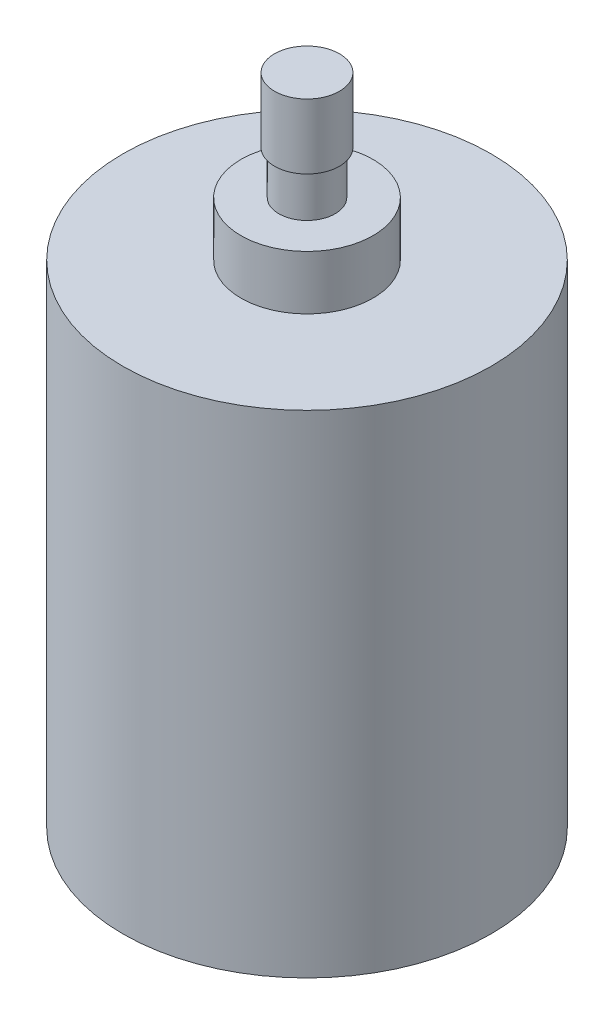
ISO-10303-21;
HEADER;
FILE_DESCRIPTION(('STEP AP214'),'2;1');
FILE_NAME('part.step','',(''),(''),'','','');
FILE_SCHEMA(('AUTOMOTIVE_DESIGN { 1 0 10303 214 1 1 1 1 }'));
ENDSEC;
DATA;
#1=APPLICATION_CONTEXT('core data for automotive mechanical design processes');
#2=APPLICATION_PROTOCOL_DEFINITION('international standard','automotive_design',2000,#1);
#3=PRODUCT_CONTEXT('',#1,'mechanical');
#4=PRODUCT('Part','Part','',(#3));
#5=PRODUCT_RELATED_PRODUCT_CATEGORY('part','',(#4));
#6=PRODUCT_DEFINITION_FORMATION('','',#4);
#7=PRODUCT_DEFINITION_CONTEXT('part definition',#1,'design');
#8=PRODUCT_DEFINITION('design','',#6,#7);
#9=PRODUCT_DEFINITION_SHAPE('','',#8);
#10=(LENGTH_UNIT() NAMED_UNIT(*) SI_UNIT(.MILLI.,.METRE.));
#11=(NAMED_UNIT(*) PLANE_ANGLE_UNIT() SI_UNIT($,.RADIAN.));
#12=(NAMED_UNIT(*) SI_UNIT($,.STERADIAN.) SOLID_ANGLE_UNIT());
#13=UNCERTAINTY_MEASURE_WITH_UNIT(LENGTH_MEASURE(1.E-05),#10,'distance_accuracy_value','');
#14=(GEOMETRIC_REPRESENTATION_CONTEXT(3) GLOBAL_UNCERTAINTY_ASSIGNED_CONTEXT((#13)) GLOBAL_UNIT_ASSIGNED_CONTEXT((#10,
#11,#12)) REPRESENTATION_CONTEXT('',''));
#15=CARTESIAN_POINT('',(0.,0.,0.));
#16=DIRECTION('',(0.,0.,1.));
#17=DIRECTION('',(1.,0.,0.));
#18=AXIS2_PLACEMENT_3D('',#15,#16,#17);
#19=CARTESIAN_POINT('',(0.,30.2,0.));
#20=DIRECTION('',(0.,1.,0.));
#21=DIRECTION('',(-1.,0.,0.));
#22=AXIS2_PLACEMENT_3D('',#19,#20,#21);
#23=CYLINDRICAL_SURFACE('',#22,2.3);
#24=CARTESIAN_POINT('',(0.,-2.5,0.));
#25=DIRECTION('',(0.,1.,0.));
#26=DIRECTION('',(-1.,0.,0.));
#27=AXIS2_PLACEMENT_3D('',#24,#25,#26);
#28=CIRCLE('',#27,2.29999999999999);
#29=CARTESIAN_POINT('',(-2.29999999999998,-2.5,0.));
#30=VERTEX_POINT('',#29);
#31=EDGE_CURVE('E10',#30,#30,#28,.T.);
#32=ORIENTED_EDGE('',*,*,#31,.T.);
#33=EDGE_LOOP('',(#32));
#34=FACE_BOUND('',#33,.T.);
#35=CARTESIAN_POINT('',(0.,0.,0.));
#36=DIRECTION('',(0.,1.,0.));
#37=DIRECTION('',(-1.,0.,0.));
#38=AXIS2_PLACEMENT_3D('',#35,#36,#37);
#39=CIRCLE('',#38,2.3);
#40=CARTESIAN_POINT('',(-2.29999999999999,0.,0.));
#41=VERTEX_POINT('',#40);
#42=EDGE_CURVE('E62',#41,#41,#39,.T.);
#43=ORIENTED_EDGE('',*,*,#42,.F.);
#44=EDGE_LOOP('',(#43));
#45=FACE_BOUND('',#44,.T.);
#46=ADVANCED_FACE('F28',(#34,#45),#23,.T.);
#47=CARTESIAN_POINT('',(0.,-2.5,0.));
#48=DIRECTION('',(0.,-1.,0.));
#49=DIRECTION('',(1.,0.,0.));
#50=AXIS2_PLACEMENT_3D('',#47,#48,#49);
#51=PLANE('',#50);
#52=ORIENTED_EDGE('',*,*,#31,.F.);
#53=EDGE_LOOP('',(#52));
#54=FACE_BOUND('',#53,.T.);
#55=ADVANCED_FACE('F70',(#54),#51,.T.);
#56=CARTESIAN_POINT('',(-1.5,30.2,0.));
#57=DIRECTION('',(0.,1.,0.));
#58=DIRECTION('',(-1.,0.,0.));
#59=AXIS2_PLACEMENT_3D('',#56,#57,#58);
#60=PLANE('',#59);
#61=CARTESIAN_POINT('',(0.,30.2,0.));
#62=DIRECTION('',(0.,1.,0.));
#63=DIRECTION('',(-1.,0.,0.));
#64=AXIS2_PLACEMENT_3D('',#61,#62,#63);
#65=CIRCLE('',#64,1.50000000000001);
#66=CARTESIAN_POINT('',(-1.5,30.2,0.));
#67=VERTEX_POINT('',#66);
#68=EDGE_CURVE('E34',#67,#67,#65,.T.);
#69=ORIENTED_EDGE('',*,*,#68,.T.);
#70=EDGE_LOOP('',(#69));
#71=FACE_BOUND('',#70,.T.);
#72=ADVANCED_FACE('F74',(#71),#60,.T.);
#73=CARTESIAN_POINT('',(0.,30.2,0.));
#74=DIRECTION('',(0.,1.,0.));
#75=DIRECTION('',(-1.,0.,0.));
#76=AXIS2_PLACEMENT_3D('',#73,#74,#75);
#77=CYLINDRICAL_SURFACE('',#76,1.50000000000001);
#78=CARTESIAN_POINT('',(0.,27.2,0.));
#79=DIRECTION('',(0.,1.,0.));
#80=DIRECTION('',(-1.,0.,0.));
#81=AXIS2_PLACEMENT_3D('',#78,#79,#80);
#82=CIRCLE('',#81,1.50000000000001);
#83=CARTESIAN_POINT('',(-1.5,27.2,0.));
#84=VERTEX_POINT('',#83);
#85=EDGE_CURVE('E38',#84,#84,#82,.T.);
#86=ORIENTED_EDGE('',*,*,#85,.T.);
#87=EDGE_LOOP('',(#86));
#88=FACE_BOUND('',#87,.T.);
#89=ORIENTED_EDGE('',*,*,#68,.F.);
#90=EDGE_LOOP('',(#89));
#91=FACE_BOUND('',#90,.T.);
#92=ADVANCED_FACE('F79',(#88,#91),#77,.T.);
#93=CARTESIAN_POINT('',(-1.29999999999999,27.2,0.));
#94=DIRECTION('',(0.,-1.,0.));
#95=DIRECTION('',(1.,0.,0.));
#96=AXIS2_PLACEMENT_3D('',#93,#94,#95);
#97=PLANE('',#96);
#98=CARTESIAN_POINT('',(0.,27.2,0.));
#99=DIRECTION('',(0.,1.,0.));
#100=DIRECTION('',(-1.,0.,0.));
#101=AXIS2_PLACEMENT_3D('',#98,#99,#100);
#102=CIRCLE('',#101,1.3);
#103=CARTESIAN_POINT('',(-1.29999999999999,27.2,0.));
#104=VERTEX_POINT('',#103);
#105=EDGE_CURVE('E42',#104,#104,#102,.T.);
#106=ORIENTED_EDGE('',*,*,#105,.T.);
#107=EDGE_LOOP('',(#106));
#108=FACE_BOUND('',#107,.T.);
#109=ORIENTED_EDGE('',*,*,#85,.F.);
#110=EDGE_LOOP('',(#109));
#111=FACE_BOUND('',#110,.T.);
#112=ADVANCED_FACE('F84',(#108,#111),#97,.T.);
#113=CARTESIAN_POINT('',(0.,30.2,0.));
#114=DIRECTION('',(0.,1.,0.));
#115=DIRECTION('',(-1.,0.,0.));
#116=AXIS2_PLACEMENT_3D('',#113,#114,#115);
#117=CYLINDRICAL_SURFACE('',#116,1.3);
#118=CARTESIAN_POINT('',(0.,25.2,0.));
#119=DIRECTION('',(0.,1.,0.));
#120=DIRECTION('',(-1.,0.,0.));
#121=AXIS2_PLACEMENT_3D('',#118,#119,#120);
#122=CIRCLE('',#121,1.3);
#123=CARTESIAN_POINT('',(-1.3,25.2,0.));
#124=VERTEX_POINT('',#123);
#125=EDGE_CURVE('E47',#124,#124,#122,.T.);
#126=ORIENTED_EDGE('',*,*,#125,.T.);
#127=EDGE_LOOP('',(#126));
#128=FACE_BOUND('',#127,.T.);
#129=ORIENTED_EDGE('',*,*,#105,.F.);
#130=EDGE_LOOP('',(#129));
#131=FACE_BOUND('',#130,.T.);
#132=ADVANCED_FACE('F88',(#128,#131),#117,.T.);
#133=CARTESIAN_POINT('',(-3.04999999999999,25.2,0.));
#134=DIRECTION('',(0.,1.,0.));
#135=DIRECTION('',(-1.,0.,0.));
#136=AXIS2_PLACEMENT_3D('',#133,#134,#135);
#137=PLANE('',#136);
#138=CARTESIAN_POINT('',(0.,25.2,0.));
#139=DIRECTION('',(0.,1.,0.));
#140=DIRECTION('',(-1.,0.,0.));
#141=AXIS2_PLACEMENT_3D('',#138,#139,#140);
#142=CIRCLE('',#141,3.05);
#143=CARTESIAN_POINT('',(-3.04999999999999,25.2,0.));
#144=VERTEX_POINT('',#143);
#145=EDGE_CURVE('E50',#144,#144,#142,.T.);
#146=ORIENTED_EDGE('',*,*,#145,.T.);
#147=EDGE_LOOP('',(#146));
#148=FACE_BOUND('',#147,.T.);
#149=ORIENTED_EDGE('',*,*,#125,.F.);
#150=EDGE_LOOP('',(#149));
#151=FACE_BOUND('',#150,.T.);
#152=ADVANCED_FACE('F92',(#148,#151),#137,.T.);
#153=CARTESIAN_POINT('',(0.,30.2,0.));
#154=DIRECTION('',(0.,1.,0.));
#155=DIRECTION('',(-1.,0.,0.));
#156=AXIS2_PLACEMENT_3D('',#153,#154,#155);
#157=CYLINDRICAL_SURFACE('',#156,3.05);
#158=CARTESIAN_POINT('',(0.,22.7,0.));
#159=DIRECTION('',(0.,1.,0.));
#160=DIRECTION('',(-1.,0.,0.));
#161=AXIS2_PLACEMENT_3D('',#158,#159,#160);
#162=CIRCLE('',#161,3.05);
#163=CARTESIAN_POINT('',(-3.05,22.7,0.));
#164=VERTEX_POINT('',#163);
#165=EDGE_CURVE('E53',#164,#164,#162,.T.);
#166=ORIENTED_EDGE('',*,*,#165,.T.);
#167=EDGE_LOOP('',(#166));
#168=FACE_BOUND('',#167,.T.);
#169=ORIENTED_EDGE('',*,*,#145,.F.);
#170=EDGE_LOOP('',(#169));
#171=FACE_BOUND('',#170,.T.);
#172=ADVANCED_FACE('F96',(#168,#171),#157,.T.);
#173=CARTESIAN_POINT('',(-8.49999999999999,22.7,0.));
#174=DIRECTION('',(0.,1.,0.));
#175=DIRECTION('',(-1.,0.,0.));
#176=AXIS2_PLACEMENT_3D('',#173,#174,#175);
#177=PLANE('',#176);
#178=CARTESIAN_POINT('',(0.,22.7,0.));
#179=DIRECTION('',(0.,1.,0.));
#180=DIRECTION('',(-1.,0.,0.));
#181=AXIS2_PLACEMENT_3D('',#178,#179,#180);
#182=CIRCLE('',#181,8.5);
#183=CARTESIAN_POINT('',(-8.49999999999999,22.7,0.));
#184=VERTEX_POINT('',#183);
#185=EDGE_CURVE('E56',#184,#184,#182,.T.);
#186=ORIENTED_EDGE('',*,*,#185,.T.);
#187=EDGE_LOOP('',(#186));
#188=FACE_BOUND('',#187,.T.);
#189=ORIENTED_EDGE('',*,*,#165,.F.);
#190=EDGE_LOOP('',(#189));
#191=FACE_BOUND('',#190,.T.);
#192=ADVANCED_FACE('F100',(#188,#191),#177,.T.);
#193=CARTESIAN_POINT('',(0.,30.2,0.));
#194=DIRECTION('',(0.,1.,0.));
#195=DIRECTION('',(-1.,0.,0.));
#196=AXIS2_PLACEMENT_3D('',#193,#194,#195);
#197=CYLINDRICAL_SURFACE('',#196,8.5);
#198=CARTESIAN_POINT('',(0.,0.,0.));
#199=DIRECTION('',(0.,1.,0.));
#200=DIRECTION('',(-1.,0.,0.));
#201=AXIS2_PLACEMENT_3D('',#198,#199,#200);
#202=CIRCLE('',#201,8.5);
#203=CARTESIAN_POINT('',(-8.49999999999999,0.,0.));
#204=VERTEX_POINT('',#203);
#205=EDGE_CURVE('E59',#204,#204,#202,.T.);
#206=ORIENTED_EDGE('',*,*,#205,.T.);
#207=EDGE_LOOP('',(#206));
#208=FACE_BOUND('',#207,.T.);
#209=ORIENTED_EDGE('',*,*,#185,.F.);
#210=EDGE_LOOP('',(#209));
#211=FACE_BOUND('',#210,.T.);
#212=ADVANCED_FACE('F104',(#208,#211),#197,.T.);
#213=CARTESIAN_POINT('',(-2.29999999999999,0.,0.));
#214=DIRECTION('',(0.,-1.,0.));
#215=DIRECTION('',(1.,0.,0.));
#216=AXIS2_PLACEMENT_3D('',#213,#214,#215);
#217=PLANE('',#216);
#218=ORIENTED_EDGE('',*,*,#42,.T.);
#219=EDGE_LOOP('',(#218));
#220=FACE_BOUND('',#219,.T.);
#221=ORIENTED_EDGE('',*,*,#205,.F.);
#222=EDGE_LOOP('',(#221));
#223=FACE_BOUND('',#222,.T.);
#224=ADVANCED_FACE('F66',(#220,#223),#217,.T.);
#225=CLOSED_SHELL('',(#46,#55,#72,#92,#112,#132,#152,#172,#192,#212,#224));
#226=MANIFOLD_SOLID_BREP('B2',#225);
#227=ADVANCED_BREP_SHAPE_REPRESENTATION('',(#18,#226),#14);
#228=SHAPE_DEFINITION_REPRESENTATION(#9,#227);
ENDSEC;
END-ISO-10303-21;
